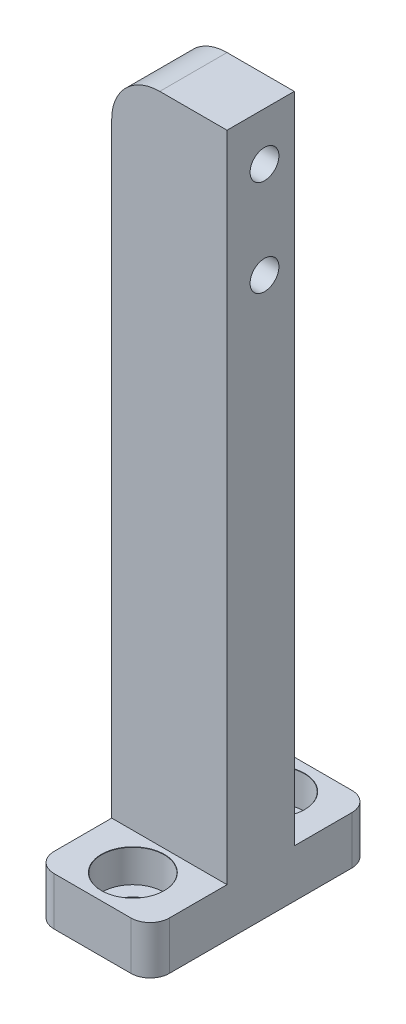
ISO-10303-21;
HEADER;
FILE_DESCRIPTION(('STEP AP214'),'2;1');
FILE_NAME('part.step','',(''),(''),'','','');
FILE_SCHEMA(('AUTOMOTIVE_DESIGN { 1 0 10303 214 1 1 1 1 }'));
ENDSEC;
DATA;
#1=APPLICATION_CONTEXT('core data for automotive mechanical design processes');
#2=APPLICATION_PROTOCOL_DEFINITION('international standard','automotive_design',2000,#1);
#3=PRODUCT_CONTEXT('',#1,'mechanical');
#4=PRODUCT('Part','Part','',(#3));
#5=PRODUCT_RELATED_PRODUCT_CATEGORY('part','',(#4));
#6=PRODUCT_DEFINITION_FORMATION('','',#4);
#7=PRODUCT_DEFINITION_CONTEXT('part definition',#1,'design');
#8=PRODUCT_DEFINITION('design','',#6,#7);
#9=PRODUCT_DEFINITION_SHAPE('','',#8);
#10=(LENGTH_UNIT() NAMED_UNIT(*) SI_UNIT(.MILLI.,.METRE.));
#11=(NAMED_UNIT(*) PLANE_ANGLE_UNIT() SI_UNIT($,.RADIAN.));
#12=(NAMED_UNIT(*) SI_UNIT($,.STERADIAN.) SOLID_ANGLE_UNIT());
#13=UNCERTAINTY_MEASURE_WITH_UNIT(LENGTH_MEASURE(1.E-05),#10,'distance_accuracy_value','');
#14=(GEOMETRIC_REPRESENTATION_CONTEXT(3) GLOBAL_UNCERTAINTY_ASSIGNED_CONTEXT((#13)) GLOBAL_UNIT_ASSIGNED_CONTEXT((#10,
#11,#12)) REPRESENTATION_CONTEXT('',''));
#15=CARTESIAN_POINT('',(0.,0.,0.));
#16=DIRECTION('',(0.,0.,1.));
#17=DIRECTION('',(1.,0.,0.));
#18=AXIS2_PLACEMENT_3D('',#15,#16,#17);
#19=CARTESIAN_POINT('',(-6.,36.5,-3.5));
#20=DIRECTION('',(0.,0.,1.));
#21=DIRECTION('',(1.,0.,0.));
#22=AXIS2_PLACEMENT_3D('',#19,#20,#21);
#23=PLANE('',#22);
#24=DIRECTION('',(0.,-1.,0.));
#25=VECTOR('',#24,1.);
#26=CARTESIAN_POINT('',(-6.,36.5,-3.5));
#27=LINE('',#26,#25);
#28=CARTESIAN_POINT('',(-6.,31.5,-3.5));
#29=VERTEX_POINT('',#28);
#30=CARTESIAN_POINT('',(-6.,-31.5,-3.5));
#31=VERTEX_POINT('',#30);
#32=EDGE_CURVE('E224',#29,#31,#27,.T.);
#33=ORIENTED_EDGE('',*,*,#32,.F.);
#34=CARTESIAN_POINT('',(-1.,31.5,-3.5));
#35=DIRECTION('',(0.,0.,1.));
#36=DIRECTION('',(1.,0.,0.));
#37=AXIS2_PLACEMENT_3D('',#34,#35,#36);
#38=CIRCLE('',#37,5.);
#39=CARTESIAN_POINT('',(-1.,36.5,-3.5));
#40=VERTEX_POINT('',#39);
#41=EDGE_CURVE('E11',#29,#40,#38,.F.);
#42=ORIENTED_EDGE('',*,*,#41,.T.);
#43=DIRECTION('',(-1.,0.,0.));
#44=VECTOR('',#43,1.);
#45=CARTESIAN_POINT('',(-6.,36.5,-3.5));
#46=LINE('',#45,#44);
#47=CARTESIAN_POINT('',(6.,36.5,-3.5));
#48=VERTEX_POINT('',#47);
#49=EDGE_CURVE('E247',#48,#40,#46,.T.);
#50=ORIENTED_EDGE('',*,*,#49,.F.);
#51=DIRECTION('',(0.,-1.,0.));
#52=VECTOR('',#51,1.);
#53=CARTESIAN_POINT('',(6.,36.5,-3.5));
#54=LINE('',#53,#52);
#55=CARTESIAN_POINT('',(6.,-31.5,-3.5));
#56=VERTEX_POINT('',#55);
#57=EDGE_CURVE('E221',#48,#56,#54,.T.);
#58=ORIENTED_EDGE('',*,*,#57,.T.);
#59=DIRECTION('',(1.,0.,0.));
#60=VECTOR('',#59,1.);
#61=CARTESIAN_POINT('',(-5.99999999999996,-31.5,-3.5));
#62=LINE('',#61,#60);
#63=EDGE_CURVE('E244',#31,#56,#62,.T.);
#64=ORIENTED_EDGE('',*,*,#63,.F.);
#65=EDGE_LOOP('',(#33,#42,#50,#58,#64));
#66=FACE_BOUND('',#65,.T.);
#67=ADVANCED_FACE('F42',(#66),#23,.F.);
#68=CARTESIAN_POINT('',(-6.,36.5,3.5));
#69=DIRECTION('',(0.,0.,-1.));
#70=DIRECTION('',(-1.,0.,0.));
#71=AXIS2_PLACEMENT_3D('',#68,#69,#70);
#72=PLANE('',#71);
#73=DIRECTION('',(1.,0.,0.));
#74=VECTOR('',#73,1.);
#75=CARTESIAN_POINT('',(-6.,36.5,3.5));
#76=LINE('',#75,#74);
#77=CARTESIAN_POINT('',(-1.,36.5,3.5));
#78=VERTEX_POINT('',#77);
#79=CARTESIAN_POINT('',(6.,36.5,3.5));
#80=VERTEX_POINT('',#79);
#81=EDGE_CURVE('E234',#78,#80,#76,.T.);
#82=ORIENTED_EDGE('',*,*,#81,.F.);
#83=CARTESIAN_POINT('',(-1.,31.5,3.5));
#84=DIRECTION('',(0.,0.,-1.));
#85=DIRECTION('',(-1.,0.,0.));
#86=AXIS2_PLACEMENT_3D('',#83,#84,#85);
#87=CIRCLE('',#86,5.);
#88=CARTESIAN_POINT('',(-6.,31.5,3.5));
#89=VERTEX_POINT('',#88);
#90=EDGE_CURVE('E156',#78,#89,#87,.F.);
#91=ORIENTED_EDGE('',*,*,#90,.T.);
#92=DIRECTION('',(0.,-1.,0.));
#93=VECTOR('',#92,1.);
#94=CARTESIAN_POINT('',(-6.,36.5,3.5));
#95=LINE('',#94,#93);
#96=CARTESIAN_POINT('',(-6.,-31.5,3.5));
#97=VERTEX_POINT('',#96);
#98=EDGE_CURVE('E227',#89,#97,#95,.T.);
#99=ORIENTED_EDGE('',*,*,#98,.T.);
#100=DIRECTION('',(-1.,0.,0.));
#101=VECTOR('',#100,1.);
#102=CARTESIAN_POINT('',(-5.99999999999996,-31.5,3.5));
#103=LINE('',#102,#101);
#104=CARTESIAN_POINT('',(6.,-31.5,3.5));
#105=VERTEX_POINT('',#104);
#106=EDGE_CURVE('E217',#105,#97,#103,.T.);
#107=ORIENTED_EDGE('',*,*,#106,.F.);
#108=DIRECTION('',(0.,-1.,0.));
#109=VECTOR('',#108,1.);
#110=CARTESIAN_POINT('',(6.,36.5,3.5));
#111=LINE('',#110,#109);
#112=EDGE_CURVE('E230',#80,#105,#111,.T.);
#113=ORIENTED_EDGE('',*,*,#112,.F.);
#114=EDGE_LOOP('',(#82,#91,#99,#107,#113));
#115=FACE_BOUND('',#114,.T.);
#116=ADVANCED_FACE('F399',(#115),#72,.F.);
#117=CARTESIAN_POINT('',(6.,36.5,3.5));
#118=DIRECTION('',(-1.,0.,0.));
#119=DIRECTION('',(0.,0.,1.));
#120=AXIS2_PLACEMENT_3D('',#117,#118,#119);
#121=PLANE('',#120);
#122=CARTESIAN_POINT('',(6.,31.5,-0.400000000000001));
#123=DIRECTION('',(1.,0.,0.));
#124=DIRECTION('',(0.,0.,-1.));
#125=AXIS2_PLACEMENT_3D('',#122,#123,#124);
#126=CIRCLE('',#125,1.5);
#127=CARTESIAN_POINT('',(6.,31.5,-1.9));
#128=VERTEX_POINT('',#127);
#129=EDGE_CURVE('E146',#128,#128,#126,.T.);
#130=ORIENTED_EDGE('',*,*,#129,.F.);
#131=EDGE_LOOP('',(#130));
#132=FACE_BOUND('',#131,.T.);
#133=CARTESIAN_POINT('',(6.,21.5,-0.400000000000001));
#134=DIRECTION('',(1.,0.,0.));
#135=DIRECTION('',(0.,0.,-1.));
#136=AXIS2_PLACEMENT_3D('',#133,#134,#135);
#137=CIRCLE('',#136,1.5);
#138=CARTESIAN_POINT('',(6.,21.5,-1.9));
#139=VERTEX_POINT('',#138);
#140=EDGE_CURVE('E321',#139,#139,#137,.T.);
#141=ORIENTED_EDGE('',*,*,#140,.F.);
#142=EDGE_LOOP('',(#141));
#143=FACE_BOUND('',#142,.T.);
#144=DIRECTION('',(0.,0.,-1.));
#145=VECTOR('',#144,1.);
#146=CARTESIAN_POINT('',(6.,-36.5,3.5));
#147=LINE('',#146,#145);
#148=CARTESIAN_POINT('',(6.,-36.5,9.5));
#149=VERTEX_POINT('',#148);
#150=CARTESIAN_POINT('',(6.,-36.5,-9.5));
#151=VERTEX_POINT('',#150);
#152=EDGE_CURVE('E240',#149,#151,#147,.T.);
#153=ORIENTED_EDGE('',*,*,#152,.T.);
#154=DIRECTION('',(0.,1.,0.));
#155=VECTOR('',#154,1.);
#156=CARTESIAN_POINT('',(6.,36.5,-9.5));
#157=LINE('',#156,#155);
#158=CARTESIAN_POINT('',(6.,-31.5,-9.5));
#159=VERTEX_POINT('',#158);
#160=EDGE_CURVE('E179',#151,#159,#157,.T.);
#161=ORIENTED_EDGE('',*,*,#160,.T.);
#162=DIRECTION('',(0.,0.,-1.));
#163=VECTOR('',#162,1.);
#164=CARTESIAN_POINT('',(6.,-31.5,11.5));
#165=LINE('',#164,#163);
#166=EDGE_CURVE('E260',#56,#159,#165,.T.);
#167=ORIENTED_EDGE('',*,*,#166,.F.);
#168=ORIENTED_EDGE('',*,*,#57,.F.);
#169=DIRECTION('',(0.,0.,-1.));
#170=VECTOR('',#169,1.);
#171=CARTESIAN_POINT('',(6.,36.5,3.5));
#172=LINE('',#171,#170);
#173=EDGE_CURVE('E239',#80,#48,#172,.T.);
#174=ORIENTED_EDGE('',*,*,#173,.F.);
#175=ORIENTED_EDGE('',*,*,#112,.T.);
#176=CARTESIAN_POINT('',(6.,-31.5,9.5));
#177=VERTEX_POINT('',#176);
#178=EDGE_CURVE('E257',#177,#105,#165,.T.);
#179=ORIENTED_EDGE('',*,*,#178,.F.);
#180=DIRECTION('',(0.,1.,0.));
#181=VECTOR('',#180,1.);
#182=CARTESIAN_POINT('',(6.,-36.5,9.5));
#183=LINE('',#182,#181);
#184=EDGE_CURVE('E183',#177,#149,#183,.F.);
#185=ORIENTED_EDGE('',*,*,#184,.T.);
#186=EDGE_LOOP('',(#153,#161,#167,#168,#174,#175,#179,#185));
#187=FACE_BOUND('',#186,.T.);
#188=ADVANCED_FACE('F402',(#132,#143,#187),#121,.F.);
#189=CARTESIAN_POINT('',(-6.,36.5,3.5));
#190=DIRECTION('',(1.,0.,0.));
#191=DIRECTION('',(0.,0.,-1.));
#192=AXIS2_PLACEMENT_3D('',#189,#190,#191);
#193=PLANE('',#192);
#194=CARTESIAN_POINT('',(-6.,21.5,-0.400000000000001));
#195=DIRECTION('',(1.,0.,0.));
#196=DIRECTION('',(0.,0.,-1.));
#197=AXIS2_PLACEMENT_3D('',#194,#195,#196);
#198=CIRCLE('',#197,1.5);
#199=CARTESIAN_POINT('',(-6.,21.5,-1.9));
#200=VERTEX_POINT('',#199);
#201=EDGE_CURVE('E325',#200,#200,#198,.F.);
#202=ORIENTED_EDGE('',*,*,#201,.F.);
#203=EDGE_LOOP('',(#202));
#204=FACE_BOUND('',#203,.T.);
#205=DIRECTION('',(0.,0.,1.));
#206=VECTOR('',#205,1.);
#207=CARTESIAN_POINT('',(-6.,31.5,3.5));
#208=LINE('',#207,#206);
#209=CARTESIAN_POINT('',(-6.,31.5,1.1));
#210=VERTEX_POINT('',#209);
#211=EDGE_CURVE('E51',#89,#210,#208,.F.);
#212=ORIENTED_EDGE('',*,*,#211,.T.);
#213=CARTESIAN_POINT('',(-6.,31.5,-0.400000000000001));
#214=DIRECTION('',(1.,0.,0.));
#215=DIRECTION('',(0.,0.,-1.));
#216=AXIS2_PLACEMENT_3D('',#213,#214,#215);
#217=CIRCLE('',#216,1.5);
#218=CARTESIAN_POINT('',(-6.,31.5,-1.9));
#219=VERTEX_POINT('',#218);
#220=EDGE_CURVE('E57',#219,#210,#217,.F.);
#221=ORIENTED_EDGE('',*,*,#220,.F.);
#222=EDGE_CURVE('E64',#219,#29,#208,.F.);
#223=ORIENTED_EDGE('',*,*,#222,.T.);
#224=ORIENTED_EDGE('',*,*,#32,.T.);
#225=DIRECTION('',(0.,0.,-1.));
#226=VECTOR('',#225,1.);
#227=CARTESIAN_POINT('',(-6.,-31.5,11.5));
#228=LINE('',#227,#226);
#229=CARTESIAN_POINT('',(-6.,-31.5,-9.5));
#230=VERTEX_POINT('',#229);
#231=EDGE_CURVE('E265',#31,#230,#228,.T.);
#232=ORIENTED_EDGE('',*,*,#231,.T.);
#233=DIRECTION('',(0.,-1.,0.));
#234=VECTOR('',#233,1.);
#235=CARTESIAN_POINT('',(-6.,36.5,-9.5));
#236=LINE('',#235,#234);
#237=CARTESIAN_POINT('',(-6.,-36.5,-9.5));
#238=VERTEX_POINT('',#237);
#239=EDGE_CURVE('E210',#230,#238,#236,.T.);
#240=ORIENTED_EDGE('',*,*,#239,.T.);
#241=DIRECTION('',(0.,0.,1.));
#242=VECTOR('',#241,1.);
#243=CARTESIAN_POINT('',(-6.,-36.5,3.5));
#244=LINE('',#243,#242);
#245=CARTESIAN_POINT('',(-6.,-36.5,9.5));
#246=VERTEX_POINT('',#245);
#247=EDGE_CURVE('E235',#238,#246,#244,.T.);
#248=ORIENTED_EDGE('',*,*,#247,.T.);
#249=DIRECTION('',(0.,-1.,0.));
#250=VECTOR('',#249,1.);
#251=CARTESIAN_POINT('',(-6.,-31.5,9.5));
#252=LINE('',#251,#250);
#253=CARTESIAN_POINT('',(-6.,-31.5,9.5));
#254=VERTEX_POINT('',#253);
#255=EDGE_CURVE('E214',#246,#254,#252,.F.);
#256=ORIENTED_EDGE('',*,*,#255,.T.);
#257=EDGE_CURVE('E261',#254,#97,#228,.T.);
#258=ORIENTED_EDGE('',*,*,#257,.T.);
#259=ORIENTED_EDGE('',*,*,#98,.F.);
#260=EDGE_LOOP('',(#212,#221,#223,#224,#232,#240,#248,#256,#258,#259));
#261=FACE_BOUND('',#260,.T.);
#262=ADVANCED_FACE('F148',(#204,#261),#193,.F.);
#263=CARTESIAN_POINT('',(0.,36.5,0.));
#264=DIRECTION('',(0.,-1.,0.));
#265=DIRECTION('',(0.,0.,-1.));
#266=AXIS2_PLACEMENT_3D('',#263,#264,#265);
#267=PLANE('',#266);
#268=ORIENTED_EDGE('',*,*,#49,.T.);
#269=DIRECTION('',(0.,0.,1.));
#270=VECTOR('',#269,1.);
#271=CARTESIAN_POINT('',(-1.,36.5,0.));
#272=LINE('',#271,#270);
#273=EDGE_CURVE('E159',#40,#78,#272,.T.);
#274=ORIENTED_EDGE('',*,*,#273,.T.);
#275=ORIENTED_EDGE('',*,*,#81,.T.);
#276=ORIENTED_EDGE('',*,*,#173,.T.);
#277=EDGE_LOOP('',(#268,#274,#275,#276));
#278=FACE_BOUND('',#277,.T.);
#279=ADVANCED_FACE('F392',(#278),#267,.F.);
#280=CARTESIAN_POINT('',(0.,-36.5,0.));
#281=DIRECTION('',(0.,-1.,0.));
#282=DIRECTION('',(0.,0.,-1.));
#283=AXIS2_PLACEMENT_3D('',#280,#281,#282);
#284=PLANE('',#283);
#285=CARTESIAN_POINT('',(0.,-36.5,7.3));
#286=DIRECTION('',(0.,1.,0.));
#287=DIRECTION('',(0.,0.,1.));
#288=AXIS2_PLACEMENT_3D('',#285,#286,#287);
#289=CIRCLE('',#288,1.7);
#290=CARTESIAN_POINT('',(0.,-36.5,9.));
#291=VERTEX_POINT('',#290);
#292=EDGE_CURVE('E302',#291,#291,#289,.T.);
#293=ORIENTED_EDGE('',*,*,#292,.T.);
#294=EDGE_LOOP('',(#293));
#295=FACE_BOUND('',#294,.T.);
#296=CARTESIAN_POINT('',(0.,-36.5,-7.3));
#297=DIRECTION('',(0.,1.,0.));
#298=DIRECTION('',(0.,0.,1.));
#299=AXIS2_PLACEMENT_3D('',#296,#297,#298);
#300=CIRCLE('',#299,1.7);
#301=CARTESIAN_POINT('',(0.,-36.5,-5.6));
#302=VERTEX_POINT('',#301);
#303=EDGE_CURVE('E275',#302,#302,#300,.T.);
#304=ORIENTED_EDGE('',*,*,#303,.T.);
#305=EDGE_LOOP('',(#304));
#306=FACE_BOUND('',#305,.T.);
#307=ORIENTED_EDGE('',*,*,#247,.F.);
#308=CARTESIAN_POINT('',(-4.,-36.5,-9.5));
#309=DIRECTION('',(0.,-1.,0.));
#310=DIRECTION('',(0.,0.,-1.));
#311=AXIS2_PLACEMENT_3D('',#308,#309,#310);
#312=CIRCLE('',#311,2.);
#313=CARTESIAN_POINT('',(-4.,-36.5,-11.5));
#314=VERTEX_POINT('',#313);
#315=EDGE_CURVE('E198',#238,#314,#312,.T.);
#316=ORIENTED_EDGE('',*,*,#315,.T.);
#317=DIRECTION('',(1.,0.,0.));
#318=VECTOR('',#317,1.);
#319=CARTESIAN_POINT('',(-6.,-36.5,-11.5));
#320=LINE('',#319,#318);
#321=CARTESIAN_POINT('',(4.,-36.5,-11.5));
#322=VERTEX_POINT('',#321);
#323=EDGE_CURVE('E271',#314,#322,#320,.T.);
#324=ORIENTED_EDGE('',*,*,#323,.T.);
#325=CARTESIAN_POINT('',(4.,-36.5,-9.5));
#326=DIRECTION('',(0.,-1.,0.));
#327=DIRECTION('',(0.,0.,-1.));
#328=AXIS2_PLACEMENT_3D('',#325,#326,#327);
#329=CIRCLE('',#328,2.);
#330=EDGE_CURVE('E201',#322,#151,#329,.T.);
#331=ORIENTED_EDGE('',*,*,#330,.T.);
#332=ORIENTED_EDGE('',*,*,#152,.F.);
#333=CARTESIAN_POINT('',(4.,-36.5,9.5));
#334=DIRECTION('',(0.,-1.,0.));
#335=DIRECTION('',(0.,0.,-1.));
#336=AXIS2_PLACEMENT_3D('',#333,#334,#335);
#337=CIRCLE('',#336,2.);
#338=CARTESIAN_POINT('',(4.,-36.5,11.5));
#339=VERTEX_POINT('',#338);
#340=EDGE_CURVE('E207',#149,#339,#337,.T.);
#341=ORIENTED_EDGE('',*,*,#340,.T.);
#342=DIRECTION('',(1.,0.,0.));
#343=VECTOR('',#342,1.);
#344=CARTESIAN_POINT('',(-6.,-36.5,11.5));
#345=LINE('',#344,#343);
#346=CARTESIAN_POINT('',(-4.,-36.5,11.5));
#347=VERTEX_POINT('',#346);
#348=EDGE_CURVE('E270',#347,#339,#345,.T.);
#349=ORIENTED_EDGE('',*,*,#348,.F.);
#350=CARTESIAN_POINT('',(-4.,-36.5,9.5));
#351=DIRECTION('',(0.,-1.,0.));
#352=DIRECTION('',(0.,0.,-1.));
#353=AXIS2_PLACEMENT_3D('',#350,#351,#352);
#354=CIRCLE('',#353,2.);
#355=EDGE_CURVE('E204',#347,#246,#354,.T.);
#356=ORIENTED_EDGE('',*,*,#355,.T.);
#357=EDGE_LOOP('',(#307,#316,#324,#331,#332,#341,#349,#356));
#358=FACE_BOUND('',#357,.T.);
#359=ADVANCED_FACE('F381',(#295,#306,#358),#284,.T.);
#360=CARTESIAN_POINT('',(0.,0.,11.5));
#361=DIRECTION('',(0.,0.,1.));
#362=DIRECTION('',(1.,0.,0.));
#363=AXIS2_PLACEMENT_3D('',#360,#361,#362);
#364=PLANE('',#363);
#365=DIRECTION('',(-1.,0.,0.));
#366=VECTOR('',#365,1.);
#367=CARTESIAN_POINT('',(-6.,-31.5,11.5));
#368=LINE('',#367,#366);
#369=CARTESIAN_POINT('',(4.,-31.5,11.5));
#370=VERTEX_POINT('',#369);
#371=CARTESIAN_POINT('',(-4.,-31.5,11.5));
#372=VERTEX_POINT('',#371);
#373=EDGE_CURVE('E276',#370,#372,#368,.T.);
#374=ORIENTED_EDGE('',*,*,#373,.T.);
#375=DIRECTION('',(0.,-1.,0.));
#376=VECTOR('',#375,1.);
#377=CARTESIAN_POINT('',(-4.,-36.5,11.5));
#378=LINE('',#377,#376);
#379=EDGE_CURVE('E171',#372,#347,#378,.T.);
#380=ORIENTED_EDGE('',*,*,#379,.T.);
#381=ORIENTED_EDGE('',*,*,#348,.T.);
#382=DIRECTION('',(0.,1.,0.));
#383=VECTOR('',#382,1.);
#384=CARTESIAN_POINT('',(4.,-31.5,11.5));
#385=LINE('',#384,#383);
#386=EDGE_CURVE('E175',#339,#370,#385,.T.);
#387=ORIENTED_EDGE('',*,*,#386,.T.);
#388=EDGE_LOOP('',(#374,#380,#381,#387));
#389=FACE_BOUND('',#388,.T.);
#390=ADVANCED_FACE('F377',(#389),#364,.T.);
#391=CARTESIAN_POINT('',(-6.,-31.5,11.5));
#392=DIRECTION('',(0.,-1.,0.));
#393=DIRECTION('',(1.,0.,0.));
#394=AXIS2_PLACEMENT_3D('',#391,#392,#393);
#395=PLANE('',#394);
#396=CARTESIAN_POINT('',(0.,-31.5,7.3));
#397=DIRECTION('',(0.,1.,0.));
#398=DIRECTION('',(0.,0.,1.));
#399=AXIS2_PLACEMENT_3D('',#396,#397,#398);
#400=CIRCLE('',#399,3.275);
#401=CARTESIAN_POINT('',(0.,-31.5,10.575));
#402=VERTEX_POINT('',#401);
#403=EDGE_CURVE('E151',#402,#402,#400,.T.);
#404=ORIENTED_EDGE('',*,*,#403,.F.);
#405=EDGE_LOOP('',(#404));
#406=FACE_BOUND('',#405,.T.);
#407=ORIENTED_EDGE('',*,*,#257,.F.);
#408=CARTESIAN_POINT('',(-4.,-31.5,9.5));
#409=DIRECTION('',(0.,-1.,0.));
#410=DIRECTION('',(1.,0.,0.));
#411=AXIS2_PLACEMENT_3D('',#408,#409,#410);
#412=CIRCLE('',#411,2.);
#413=EDGE_CURVE('E165',#254,#372,#412,.F.);
#414=ORIENTED_EDGE('',*,*,#413,.T.);
#415=ORIENTED_EDGE('',*,*,#373,.F.);
#416=CARTESIAN_POINT('',(4.,-31.5,9.5));
#417=DIRECTION('',(0.,-1.,0.));
#418=DIRECTION('',(1.,0.,0.));
#419=AXIS2_PLACEMENT_3D('',#416,#417,#418);
#420=CIRCLE('',#419,2.);
#421=EDGE_CURVE('E168',#370,#177,#420,.F.);
#422=ORIENTED_EDGE('',*,*,#421,.T.);
#423=ORIENTED_EDGE('',*,*,#178,.T.);
#424=ORIENTED_EDGE('',*,*,#106,.T.);
#425=EDGE_LOOP('',(#407,#414,#415,#422,#423,#424));
#426=FACE_BOUND('',#425,.T.);
#427=ADVANCED_FACE('F380',(#406,#426),#395,.F.);
#428=CARTESIAN_POINT('',(0.,-31.5,-7.3));
#429=DIRECTION('',(0.,1.,0.));
#430=DIRECTION('',(0.,0.,1.));
#431=AXIS2_PLACEMENT_3D('',#428,#429,#430);
#432=CIRCLE('',#431,3.275);
#433=CARTESIAN_POINT('',(0.,-31.5,-4.025));
#434=VERTEX_POINT('',#433);
#435=EDGE_CURVE('E298',#434,#434,#432,.T.);
#436=ORIENTED_EDGE('',*,*,#435,.F.);
#437=EDGE_LOOP('',(#436));
#438=FACE_BOUND('',#437,.T.);
#439=DIRECTION('',(-1.,0.,0.));
#440=VECTOR('',#439,1.);
#441=CARTESIAN_POINT('',(-6.,-31.5,-11.5));
#442=LINE('',#441,#440);
#443=CARTESIAN_POINT('',(4.,-31.5,-11.5));
#444=VERTEX_POINT('',#443);
#445=CARTESIAN_POINT('',(-4.,-31.5,-11.5));
#446=VERTEX_POINT('',#445);
#447=EDGE_CURVE('E266',#444,#446,#442,.T.);
#448=ORIENTED_EDGE('',*,*,#447,.T.);
#449=CARTESIAN_POINT('',(-4.,-31.5,-9.5));
#450=DIRECTION('',(0.,-1.,0.));
#451=DIRECTION('',(1.,0.,0.));
#452=AXIS2_PLACEMENT_3D('',#449,#450,#451);
#453=CIRCLE('',#452,2.);
#454=EDGE_CURVE('E186',#446,#230,#453,.F.);
#455=ORIENTED_EDGE('',*,*,#454,.T.);
#456=ORIENTED_EDGE('',*,*,#231,.F.);
#457=ORIENTED_EDGE('',*,*,#63,.T.);
#458=ORIENTED_EDGE('',*,*,#166,.T.);
#459=CARTESIAN_POINT('',(4.,-31.5,-9.5));
#460=DIRECTION('',(0.,-1.,0.));
#461=DIRECTION('',(1.,0.,0.));
#462=AXIS2_PLACEMENT_3D('',#459,#460,#461);
#463=CIRCLE('',#462,2.);
#464=EDGE_CURVE('E189',#159,#444,#463,.F.);
#465=ORIENTED_EDGE('',*,*,#464,.T.);
#466=EDGE_LOOP('',(#448,#455,#456,#457,#458,#465));
#467=FACE_BOUND('',#466,.T.);
#468=ADVANCED_FACE('F387',(#438,#467),#395,.F.);
#469=CARTESIAN_POINT('',(0.,0.,-11.5));
#470=DIRECTION('',(0.,0.,1.));
#471=DIRECTION('',(1.,0.,0.));
#472=AXIS2_PLACEMENT_3D('',#469,#470,#471);
#473=PLANE('',#472);
#474=ORIENTED_EDGE('',*,*,#323,.F.);
#475=DIRECTION('',(0.,-1.,0.));
#476=VECTOR('',#475,1.);
#477=CARTESIAN_POINT('',(-4.,0.,-11.5));
#478=LINE('',#477,#476);
#479=EDGE_CURVE('E192',#314,#446,#478,.F.);
#480=ORIENTED_EDGE('',*,*,#479,.T.);
#481=ORIENTED_EDGE('',*,*,#447,.F.);
#482=DIRECTION('',(0.,1.,0.));
#483=VECTOR('',#482,1.);
#484=CARTESIAN_POINT('',(4.,0.,-11.5));
#485=LINE('',#484,#483);
#486=EDGE_CURVE('E195',#444,#322,#485,.F.);
#487=ORIENTED_EDGE('',*,*,#486,.T.);
#488=EDGE_LOOP('',(#474,#480,#481,#487));
#489=FACE_BOUND('',#488,.T.);
#490=ADVANCED_FACE('F383',(#489),#473,.F.);
#491=CARTESIAN_POINT('',(-4.,36.5,-9.5));
#492=DIRECTION('',(0.,-1.,0.));
#493=DIRECTION('',(0.,0.,-1.));
#494=AXIS2_PLACEMENT_3D('',#491,#492,#493);
#495=CYLINDRICAL_SURFACE('',#494,2.);
#496=ORIENTED_EDGE('',*,*,#454,.F.);
#497=ORIENTED_EDGE('',*,*,#479,.F.);
#498=ORIENTED_EDGE('',*,*,#315,.F.);
#499=ORIENTED_EDGE('',*,*,#239,.F.);
#500=EDGE_LOOP('',(#496,#497,#498,#499));
#501=FACE_BOUND('',#500,.T.);
#502=ADVANCED_FACE('F386',(#501),#495,.T.);
#503=CARTESIAN_POINT('',(4.,36.5,-9.5));
#504=DIRECTION('',(0.,1.,0.));
#505=DIRECTION('',(0.,0.,1.));
#506=AXIS2_PLACEMENT_3D('',#503,#504,#505);
#507=CYLINDRICAL_SURFACE('',#506,2.);
#508=ORIENTED_EDGE('',*,*,#330,.F.);
#509=ORIENTED_EDGE('',*,*,#486,.F.);
#510=ORIENTED_EDGE('',*,*,#464,.F.);
#511=ORIENTED_EDGE('',*,*,#160,.F.);
#512=EDGE_LOOP('',(#508,#509,#510,#511));
#513=FACE_BOUND('',#512,.T.);
#514=ADVANCED_FACE('F415',(#513),#507,.T.);
#515=CARTESIAN_POINT('',(-4.,0.,9.5));
#516=DIRECTION('',(0.,1.,0.));
#517=DIRECTION('',(0.,0.,1.));
#518=AXIS2_PLACEMENT_3D('',#515,#516,#517);
#519=CYLINDRICAL_SURFACE('',#518,2.);
#520=ORIENTED_EDGE('',*,*,#413,.F.);
#521=ORIENTED_EDGE('',*,*,#255,.F.);
#522=ORIENTED_EDGE('',*,*,#355,.F.);
#523=ORIENTED_EDGE('',*,*,#379,.F.);
#524=EDGE_LOOP('',(#520,#521,#522,#523));
#525=FACE_BOUND('',#524,.T.);
#526=ADVANCED_FACE('F419',(#525),#519,.T.);
#527=CARTESIAN_POINT('',(4.,0.,9.5));
#528=DIRECTION('',(0.,-1.,0.));
#529=DIRECTION('',(0.,0.,-1.));
#530=AXIS2_PLACEMENT_3D('',#527,#528,#529);
#531=CYLINDRICAL_SURFACE('',#530,2.);
#532=ORIENTED_EDGE('',*,*,#340,.F.);
#533=ORIENTED_EDGE('',*,*,#184,.F.);
#534=ORIENTED_EDGE('',*,*,#421,.F.);
#535=ORIENTED_EDGE('',*,*,#386,.F.);
#536=EDGE_LOOP('',(#532,#533,#534,#535));
#537=FACE_BOUND('',#536,.T.);
#538=ADVANCED_FACE('F375',(#537),#531,.T.);
#539=CARTESIAN_POINT('',(0.,-31.5,-7.3));
#540=DIRECTION('',(0.,1.,0.));
#541=DIRECTION('',(0.,0.,1.));
#542=AXIS2_PLACEMENT_3D('',#539,#540,#541);
#543=CYLINDRICAL_SURFACE('',#542,1.7);
#544=ORIENTED_EDGE('',*,*,#303,.F.);
#545=EDGE_LOOP('',(#544));
#546=FACE_BOUND('',#545,.T.);
#547=CARTESIAN_POINT('',(0.,-34.9,-7.3));
#548=DIRECTION('',(0.,1.,0.));
#549=DIRECTION('',(0.,0.,1.));
#550=AXIS2_PLACEMENT_3D('',#547,#548,#549);
#551=CIRCLE('',#550,1.7);
#552=CARTESIAN_POINT('',(0.,-34.9,-5.6));
#553=VERTEX_POINT('',#552);
#554=EDGE_CURVE('E286',#553,#553,#551,.T.);
#555=ORIENTED_EDGE('',*,*,#554,.T.);
#556=EDGE_LOOP('',(#555));
#557=FACE_BOUND('',#556,.T.);
#558=ADVANCED_FACE('F371',(#546,#557),#543,.F.);
#559=CARTESIAN_POINT('',(3.25000000000002,-34.9,-7.3));
#560=DIRECTION('',(0.,-1.,0.));
#561=DIRECTION('',(0.,0.,-1.));
#562=AXIS2_PLACEMENT_3D('',#559,#560,#561);
#563=PLANE('',#562);
#564=ORIENTED_EDGE('',*,*,#554,.F.);
#565=EDGE_LOOP('',(#564));
#566=FACE_BOUND('',#565,.T.);
#567=CARTESIAN_POINT('',(0.,-34.9,-7.3));
#568=DIRECTION('',(0.,1.,0.));
#569=DIRECTION('',(0.,0.,1.));
#570=AXIS2_PLACEMENT_3D('',#567,#568,#569);
#571=CIRCLE('',#570,3.25);
#572=CARTESIAN_POINT('',(0.,-34.9,-4.05));
#573=VERTEX_POINT('',#572);
#574=EDGE_CURVE('E290',#573,#573,#571,.T.);
#575=ORIENTED_EDGE('',*,*,#574,.T.);
#576=EDGE_LOOP('',(#575));
#577=FACE_BOUND('',#576,.T.);
#578=ADVANCED_FACE('F367',(#566,#577),#563,.F.);
#579=CARTESIAN_POINT('',(0.,-31.5,-7.3));
#580=DIRECTION('',(0.,1.,0.));
#581=DIRECTION('',(0.,0.,1.));
#582=AXIS2_PLACEMENT_3D('',#579,#580,#581);
#583=CYLINDRICAL_SURFACE('',#582,3.25);
#584=ORIENTED_EDGE('',*,*,#574,.F.);
#585=EDGE_LOOP('',(#584));
#586=FACE_BOUND('',#585,.T.);
#587=CARTESIAN_POINT('',(0.,-31.525,-7.3));
#588=DIRECTION('',(0.,1.,0.));
#589=DIRECTION('',(0.,0.,1.));
#590=AXIS2_PLACEMENT_3D('',#587,#588,#589);
#591=CIRCLE('',#590,3.25);
#592=CARTESIAN_POINT('',(0.,-31.525,-4.05));
#593=VERTEX_POINT('',#592);
#594=EDGE_CURVE('E294',#593,#593,#591,.T.);
#595=ORIENTED_EDGE('',*,*,#594,.T.);
#596=EDGE_LOOP('',(#595));
#597=FACE_BOUND('',#596,.T.);
#598=ADVANCED_FACE('F363',(#586,#597),#583,.F.);
#599=CARTESIAN_POINT('',(0.,-31.5,-7.3));
#600=DIRECTION('',(0.,1.,0.));
#601=DIRECTION('',(0.,0.,1.));
#602=AXIS2_PLACEMENT_3D('',#599,#600,#601);
#603=CONICAL_SURFACE('',#602,3.275,0.785398163397518);
#604=ORIENTED_EDGE('',*,*,#594,.F.);
#605=EDGE_LOOP('',(#604));
#606=FACE_BOUND('',#605,.T.);
#607=ORIENTED_EDGE('',*,*,#435,.T.);
#608=EDGE_LOOP('',(#607));
#609=FACE_BOUND('',#608,.T.);
#610=ADVANCED_FACE('F359',(#606,#609),#603,.F.);
#611=CARTESIAN_POINT('',(0.,-31.5,7.3));
#612=DIRECTION('',(0.,1.,0.));
#613=DIRECTION('',(0.,0.,1.));
#614=AXIS2_PLACEMENT_3D('',#611,#612,#613);
#615=CYLINDRICAL_SURFACE('',#614,1.7);
#616=ORIENTED_EDGE('',*,*,#292,.F.);
#617=EDGE_LOOP('',(#616));
#618=FACE_BOUND('',#617,.T.);
#619=CARTESIAN_POINT('',(0.,-34.9,7.3));
#620=DIRECTION('',(0.,1.,0.));
#621=DIRECTION('',(0.,0.,1.));
#622=AXIS2_PLACEMENT_3D('',#619,#620,#621);
#623=CIRCLE('',#622,1.7);
#624=CARTESIAN_POINT('',(0.,-34.9,9.));
#625=VERTEX_POINT('',#624);
#626=EDGE_CURVE('E306',#625,#625,#623,.T.);
#627=ORIENTED_EDGE('',*,*,#626,.T.);
#628=EDGE_LOOP('',(#627));
#629=FACE_BOUND('',#628,.T.);
#630=ADVANCED_FACE('F355',(#618,#629),#615,.F.);
#631=CARTESIAN_POINT('',(3.25000000000002,-34.9,7.3));
#632=DIRECTION('',(0.,-1.,0.));
#633=DIRECTION('',(0.,0.,-1.));
#634=AXIS2_PLACEMENT_3D('',#631,#632,#633);
#635=PLANE('',#634);
#636=ORIENTED_EDGE('',*,*,#626,.F.);
#637=EDGE_LOOP('',(#636));
#638=FACE_BOUND('',#637,.T.);
#639=CARTESIAN_POINT('',(0.,-34.9,7.3));
#640=DIRECTION('',(0.,1.,0.));
#641=DIRECTION('',(0.,0.,1.));
#642=AXIS2_PLACEMENT_3D('',#639,#640,#641);
#643=CIRCLE('',#642,3.25);
#644=CARTESIAN_POINT('',(0.,-34.9,10.55));
#645=VERTEX_POINT('',#644);
#646=EDGE_CURVE('E310',#645,#645,#643,.T.);
#647=ORIENTED_EDGE('',*,*,#646,.T.);
#648=EDGE_LOOP('',(#647));
#649=FACE_BOUND('',#648,.T.);
#650=ADVANCED_FACE('F351',(#638,#649),#635,.F.);
#651=CARTESIAN_POINT('',(0.,-31.5,7.3));
#652=DIRECTION('',(0.,1.,0.));
#653=DIRECTION('',(0.,0.,1.));
#654=AXIS2_PLACEMENT_3D('',#651,#652,#653);
#655=CYLINDRICAL_SURFACE('',#654,3.25);
#656=ORIENTED_EDGE('',*,*,#646,.F.);
#657=EDGE_LOOP('',(#656));
#658=FACE_BOUND('',#657,.T.);
#659=CARTESIAN_POINT('',(0.,-31.525,7.3));
#660=DIRECTION('',(0.,1.,0.));
#661=DIRECTION('',(0.,0.,1.));
#662=AXIS2_PLACEMENT_3D('',#659,#660,#661);
#663=CIRCLE('',#662,3.25);
#664=CARTESIAN_POINT('',(0.,-31.525,10.55));
#665=VERTEX_POINT('',#664);
#666=EDGE_CURVE('E314',#665,#665,#663,.T.);
#667=ORIENTED_EDGE('',*,*,#666,.T.);
#668=EDGE_LOOP('',(#667));
#669=FACE_BOUND('',#668,.T.);
#670=ADVANCED_FACE('F347',(#658,#669),#655,.F.);
#671=CARTESIAN_POINT('',(0.,-31.5,7.3));
#672=DIRECTION('',(0.,1.,0.));
#673=DIRECTION('',(0.,0.,1.));
#674=AXIS2_PLACEMENT_3D('',#671,#672,#673);
#675=CONICAL_SURFACE('',#674,3.275,0.785398163397518);
#676=ORIENTED_EDGE('',*,*,#666,.F.);
#677=EDGE_LOOP('',(#676));
#678=FACE_BOUND('',#677,.T.);
#679=ORIENTED_EDGE('',*,*,#403,.T.);
#680=EDGE_LOOP('',(#679));
#681=FACE_BOUND('',#680,.T.);
#682=ADVANCED_FACE('F344',(#678,#681),#675,.F.);
#683=CARTESIAN_POINT('',(-1.,31.5,0.));
#684=DIRECTION('',(0.,0.,1.));
#685=DIRECTION('',(1.,0.,0.));
#686=AXIS2_PLACEMENT_3D('',#683,#684,#685);
#687=CYLINDRICAL_SURFACE('',#686,5.);
#688=CARTESIAN_POINT('',(-6.,31.5,-1.9));
#689=CARTESIAN_POINT('',(-6.00000277540116,31.5412216851379,-1.90000074088228));
#690=CARTESIAN_POINT('',(-5.99948961836044,31.5824227723611,-1.8982996758482));
#691=CARTESIAN_POINT('',(-5.99746104814917,31.6645131970998,-1.89152015595064));
#692=CARTESIAN_POINT('',(-5.99594583377207,31.7054025948229,-1.88644237097768));
#693=CARTESIAN_POINT('',(-5.98995421258275,31.8269578970226,-1.86622618623275));
#694=CARTESIAN_POINT('',(-5.98403144129011,31.9067825362229,-1.84610455372686));
#695=CARTESIAN_POINT('',(-5.96895666939261,32.0617357443794,-1.79325670100849));
#696=CARTESIAN_POINT('',(-5.95980542419465,32.1368654070421,-1.76053342919717));
#697=CARTESIAN_POINT('',(-5.93922400356688,32.2806029056603,-1.68347556917447));
#698=CARTESIAN_POINT('',(-5.92779293781697,32.3492081781914,-1.6391364425884));
#699=CARTESIAN_POINT('',(-5.90350773366123,32.4798709030833,-1.53877738187436));
#700=CARTESIAN_POINT('',(-5.89062457585254,32.5417148050816,-1.48248657547265));
#701=CARTESIAN_POINT('',(-5.86505906394763,32.6552459876862,-1.3603945458));
#702=CARTESIAN_POINT('',(-5.85237675569745,32.7069309792808,-1.29459118493801));
#703=CARTESIAN_POINT('',(-5.82834085702409,32.799801548353,-1.15352757560834));
#704=CARTESIAN_POINT('',(-5.81702353912299,32.8407250209213,-1.07808801081573));
#705=CARTESIAN_POINT('',(-5.79743581611077,32.9092152178897,-0.921006933559127));
#706=CARTESIAN_POINT('',(-5.78916453790634,32.9367857703828,-0.839367206367319));
#707=CARTESIAN_POINT('',(-5.77690877406439,32.9770161266059,-0.67461061428542));
#708=CARTESIAN_POINT('',(-5.77281078115892,32.9900716823,-0.591599054307653));
#709=CARTESIAN_POINT('',(-5.76902789155248,33.0021373248312,-0.424468664684638));
#710=CARTESIAN_POINT('',(-5.76934202073304,33.0011505119741,-0.34035008354735));
#711=CARTESIAN_POINT('',(-5.77424745373487,32.9854697317424,-0.176615651091418));
#712=CARTESIAN_POINT('',(-5.77868393486783,32.9712719020863,-0.0969468780719391));
#713=CARTESIAN_POINT('',(-5.79108364901659,32.9303739073488,0.0588206188714732));
#714=CARTESIAN_POINT('',(-5.79904719164088,32.9036726446935,0.134919028737175));
#715=CARTESIAN_POINT('',(-5.81772739367134,32.8381600664014,0.282600843493007));
#716=CARTESIAN_POINT('',(-5.82848030540671,32.7991877230494,0.35410803358654));
#717=CARTESIAN_POINT('',(-5.85151003381557,32.7103514842924,0.48973288579314));
#718=CARTESIAN_POINT('',(-5.86378719924559,32.6604850942874,0.553848850262728));
#719=CARTESIAN_POINT('',(-5.88910888214206,32.5488186325644,0.675680240235283));
#720=CARTESIAN_POINT('',(-5.90216405760601,32.4866078830836,0.733017642104605));
#721=CARTESIAN_POINT('',(-5.92712015117901,32.3532757925806,0.836545199318241));
#722=CARTESIAN_POINT('',(-5.93902077572235,32.2821521957842,0.882732523971359));
#723=CARTESIAN_POINT('',(-5.96043803707882,32.1323143053728,0.962883646878002));
#724=CARTESIAN_POINT('',(-5.96993688960351,32.0535490389824,0.996757028032598));
#725=CARTESIAN_POINT('',(-5.98534218707386,31.8911300657569,1.05062447982789));
#726=CARTESIAN_POINT('',(-5.99125388779918,31.8074837086215,1.07063886233264));
#727=CARTESIAN_POINT('',(-5.99668121948922,31.6858837291754,1.08890712015452));
#728=CARTESIAN_POINT('',(-5.99792349194399,31.648811461833,1.09306666526517));
#729=CARTESIAN_POINT('',(-5.99958281890525,31.5744990174066,1.09861053003616));
#730=CARTESIAN_POINT('',(-6.00000113900092,31.5372591860344,1.09999910594285));
#731=CARTESIAN_POINT('',(-6.00000000000002,31.5,1.10000000000005));
#732=B_SPLINE_CURVE_WITH_KNOTS('',3,(#688,#689,#690,#691,#692,#693,#694,#695,#696,#697,#698,
#699,#700,#701,#702,#703,#704,#705,#706,#707,#708,#709,#710,#711,#712,#713,#714,#715,#716,#717,
#718,#719,#720,#721,#722,#723,#724,#725,#726,#727,#728,#729,#730,#731),.UNSPECIFIED.,.F.,.F.,(4,
2,2,2,2,2,2,2,2,2,2,2,2,2,2,2,2,2,2,2,2,4),(0.,0.123586349299509,0.247148188235251,
0.493467705903285,0.739729627259754,0.98608790829237,1.23877657706038,1.49152211668281,
1.74994856887333,2.00830088994153,2.25942192987994,2.5104875276088,2.75248923057988,
2.99451218087958,3.2398536437702,3.48525134577321,3.74087441324127,3.99656230813591,
4.25409142087119,4.51124229334193,4.6231253520981,4.73483642426842),.UNSPECIFIED.);
#733=EDGE_CURVE('E140',#219,#210,#732,.T.);
#734=ORIENTED_EDGE('',*,*,#733,.T.);
#735=ORIENTED_EDGE('',*,*,#211,.F.);
#736=ORIENTED_EDGE('',*,*,#90,.F.);
#737=ORIENTED_EDGE('',*,*,#273,.F.);
#738=ORIENTED_EDGE('',*,*,#41,.F.);
#739=ORIENTED_EDGE('',*,*,#222,.F.);
#740=EDGE_LOOP('',(#734,#735,#736,#737,#738,#739));
#741=FACE_BOUND('',#740,.T.);
#742=ADVANCED_FACE('F44',(#741),#687,.T.);
#743=CARTESIAN_POINT('',(-6.001,31.5,-0.400000000000001));
#744=DIRECTION('',(1.,0.,0.));
#745=DIRECTION('',(0.,0.,-1.));
#746=AXIS2_PLACEMENT_3D('',#743,#744,#745);
#747=CYLINDRICAL_SURFACE('',#746,1.5);
#748=ORIENTED_EDGE('',*,*,#129,.T.);
#749=EDGE_LOOP('',(#748));
#750=FACE_BOUND('',#749,.T.);
#751=ORIENTED_EDGE('',*,*,#220,.T.);
#752=ORIENTED_EDGE('',*,*,#733,.F.);
#753=EDGE_LOOP('',(#751,#752));
#754=FACE_BOUND('',#753,.T.);
#755=ADVANCED_FACE('F141',(#750,#754),#747,.F.);
#756=CARTESIAN_POINT('',(-6.001,21.5,-0.400000000000001));
#757=DIRECTION('',(1.,0.,0.));
#758=DIRECTION('',(0.,0.,-1.));
#759=AXIS2_PLACEMENT_3D('',#756,#757,#758);
#760=CYLINDRICAL_SURFACE('',#759,1.5);
#761=ORIENTED_EDGE('',*,*,#140,.T.);
#762=EDGE_LOOP('',(#761));
#763=FACE_BOUND('',#762,.T.);
#764=ORIENTED_EDGE('',*,*,#201,.T.);
#765=EDGE_LOOP('',(#764));
#766=FACE_BOUND('',#765,.T.);
#767=ADVANCED_FACE('F339',(#763,#766),#760,.F.);
#768=CLOSED_SHELL('',(#67,#116,#188,#262,#279,#359,#390,#427,#468,#490,#502,#514,#526,#538,#558,
#578,#598,#610,#630,#650,#670,#682,#742,#755,#767));
#769=MANIFOLD_SOLID_BREP('B2',#768);
#770=ADVANCED_BREP_SHAPE_REPRESENTATION('',(#18,#769),#14);
#771=SHAPE_DEFINITION_REPRESENTATION(#9,#770);
ENDSEC;
END-ISO-10303-21;
